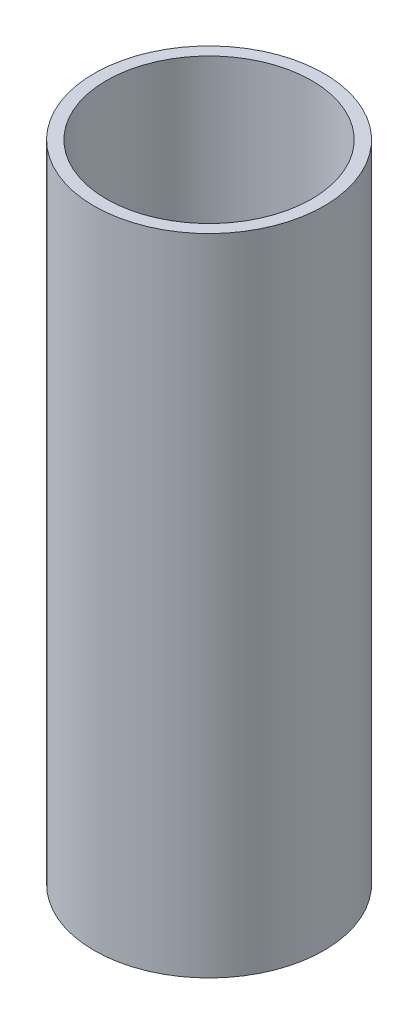
ISO-10303-21;
HEADER;
FILE_DESCRIPTION(('STEP AP214'),'2;1');
FILE_NAME('part.step','',(''),(''),'','','');
FILE_SCHEMA(('AUTOMOTIVE_DESIGN { 1 0 10303 214 1 1 1 1 }'));
ENDSEC;
DATA;
#1=APPLICATION_CONTEXT('core data for automotive mechanical design processes');
#2=APPLICATION_PROTOCOL_DEFINITION('international standard','automotive_design',2000,#1);
#3=PRODUCT_CONTEXT('',#1,'mechanical');
#4=PRODUCT('Part','Part','',(#3));
#5=PRODUCT_RELATED_PRODUCT_CATEGORY('part','',(#4));
#6=PRODUCT_DEFINITION_FORMATION('','',#4);
#7=PRODUCT_DEFINITION_CONTEXT('part definition',#1,'design');
#8=PRODUCT_DEFINITION('design','',#6,#7);
#9=PRODUCT_DEFINITION_SHAPE('','',#8);
#10=(LENGTH_UNIT() NAMED_UNIT(*) SI_UNIT(.MILLI.,.METRE.));
#11=(NAMED_UNIT(*) PLANE_ANGLE_UNIT() SI_UNIT($,.RADIAN.));
#12=(NAMED_UNIT(*) SI_UNIT($,.STERADIAN.) SOLID_ANGLE_UNIT());
#13=UNCERTAINTY_MEASURE_WITH_UNIT(LENGTH_MEASURE(1.E-05),#10,'distance_accuracy_value','');
#14=(GEOMETRIC_REPRESENTATION_CONTEXT(3) GLOBAL_UNCERTAINTY_ASSIGNED_CONTEXT((#13)) GLOBAL_UNIT_ASSIGNED_CONTEXT((#10,
#11,#12)) REPRESENTATION_CONTEXT('',''));
#15=CARTESIAN_POINT('',(0.,0.,0.));
#16=DIRECTION('',(0.,0.,1.));
#17=DIRECTION('',(1.,0.,0.));
#18=AXIS2_PLACEMENT_3D('',#15,#16,#17);
#19=CARTESIAN_POINT('',(0.,280.506910522292,0.));
#20=DIRECTION('',(0.,-1.,0.));
#21=DIRECTION('',(0.,0.,-1.));
#22=AXIS2_PLACEMENT_3D('',#19,#20,#21);
#23=CYLINDRICAL_SURFACE('',#22,50.);
#24=CARTESIAN_POINT('',(0.,280.506910522292,0.));
#25=DIRECTION('',(0.,1.,0.));
#26=DIRECTION('',(0.,0.,1.));
#27=AXIS2_PLACEMENT_3D('',#24,#25,#26);
#28=CIRCLE('',#27,50.);
#29=CARTESIAN_POINT('',(0.,280.506910522292,50.));
#30=VERTEX_POINT('',#29);
#31=EDGE_CURVE('E10',#30,#30,#28,.T.);
#32=ORIENTED_EDGE('',*,*,#31,.F.);
#33=EDGE_LOOP('',(#32));
#34=FACE_BOUND('',#33,.T.);
#35=CARTESIAN_POINT('',(0.,0.,0.));
#36=DIRECTION('',(0.,1.,0.));
#37=DIRECTION('',(0.,0.,1.));
#38=AXIS2_PLACEMENT_3D('',#35,#36,#37);
#39=CIRCLE('',#38,50.);
#40=CARTESIAN_POINT('',(0.,0.,50.));
#41=VERTEX_POINT('',#40);
#42=EDGE_CURVE('E37',#41,#41,#39,.T.);
#43=ORIENTED_EDGE('',*,*,#42,.T.);
#44=EDGE_LOOP('',(#43));
#45=FACE_BOUND('',#44,.T.);
#46=ADVANCED_FACE('F40',(#34,#45),#23,.T.);
#47=CARTESIAN_POINT('',(0.,280.506910522292,0.));
#48=DIRECTION('',(0.,1.,0.));
#49=DIRECTION('',(0.,0.,1.));
#50=AXIS2_PLACEMENT_3D('',#47,#48,#49);
#51=PLANE('',#50);
#52=CARTESIAN_POINT('',(0.,280.506910522292,0.));
#53=DIRECTION('',(0.,1.,0.));
#54=DIRECTION('',(0.,0.,1.));
#55=AXIS2_PLACEMENT_3D('',#52,#53,#54);
#56=CIRCLE('',#55,44.6649698708194);
#57=CARTESIAN_POINT('',(0.,280.506910522292,44.6649698708194));
#58=VERTEX_POINT('',#57);
#59=EDGE_CURVE('E50',#58,#58,#56,.T.);
#60=ORIENTED_EDGE('',*,*,#59,.F.);
#61=EDGE_LOOP('',(#60));
#62=FACE_BOUND('',#61,.T.);
#63=ORIENTED_EDGE('',*,*,#31,.T.);
#64=EDGE_LOOP('',(#63));
#65=FACE_BOUND('',#64,.T.);
#66=ADVANCED_FACE('F59',(#62,#65),#51,.T.);
#67=CARTESIAN_POINT('',(0.,0.,0.));
#68=DIRECTION('',(0.,1.,0.));
#69=DIRECTION('',(0.,0.,1.));
#70=AXIS2_PLACEMENT_3D('',#67,#68,#69);
#71=PLANE('',#70);
#72=CARTESIAN_POINT('',(0.,0.,0.));
#73=DIRECTION('',(0.,1.,0.));
#74=DIRECTION('',(0.,0.,1.));
#75=AXIS2_PLACEMENT_3D('',#72,#73,#74);
#76=CIRCLE('',#75,44.6649698708194);
#77=CARTESIAN_POINT('',(0.,0.,44.6649698708194));
#78=VERTEX_POINT('',#77);
#79=EDGE_CURVE('E47',#78,#78,#76,.T.);
#80=ORIENTED_EDGE('',*,*,#79,.T.);
#81=EDGE_LOOP('',(#80));
#82=FACE_BOUND('',#81,.T.);
#83=ORIENTED_EDGE('',*,*,#42,.F.);
#84=EDGE_LOOP('',(#83));
#85=FACE_BOUND('',#84,.T.);
#86=ADVANCED_FACE('F58',(#82,#85),#71,.F.);
#87=CARTESIAN_POINT('',(0.,280.506910522292,0.));
#88=DIRECTION('',(0.,-1.,0.));
#89=DIRECTION('',(0.,0.,-1.));
#90=AXIS2_PLACEMENT_3D('',#87,#88,#89);
#91=CYLINDRICAL_SURFACE('',#90,44.6649698708194);
#92=ORIENTED_EDGE('',*,*,#59,.T.);
#93=EDGE_LOOP('',(#92));
#94=FACE_BOUND('',#93,.T.);
#95=ORIENTED_EDGE('',*,*,#79,.F.);
#96=EDGE_LOOP('',(#95));
#97=FACE_BOUND('',#96,.T.);
#98=ADVANCED_FACE('F54',(#94,#97),#91,.F.);
#99=CLOSED_SHELL('',(#46,#66,#86,#98));
#100=MANIFOLD_SOLID_BREP('B2',#99);
#101=ADVANCED_BREP_SHAPE_REPRESENTATION('',(#18,#100),#14);
#102=SHAPE_DEFINITION_REPRESENTATION(#9,#101);
ENDSEC;
END-ISO-10303-21;
